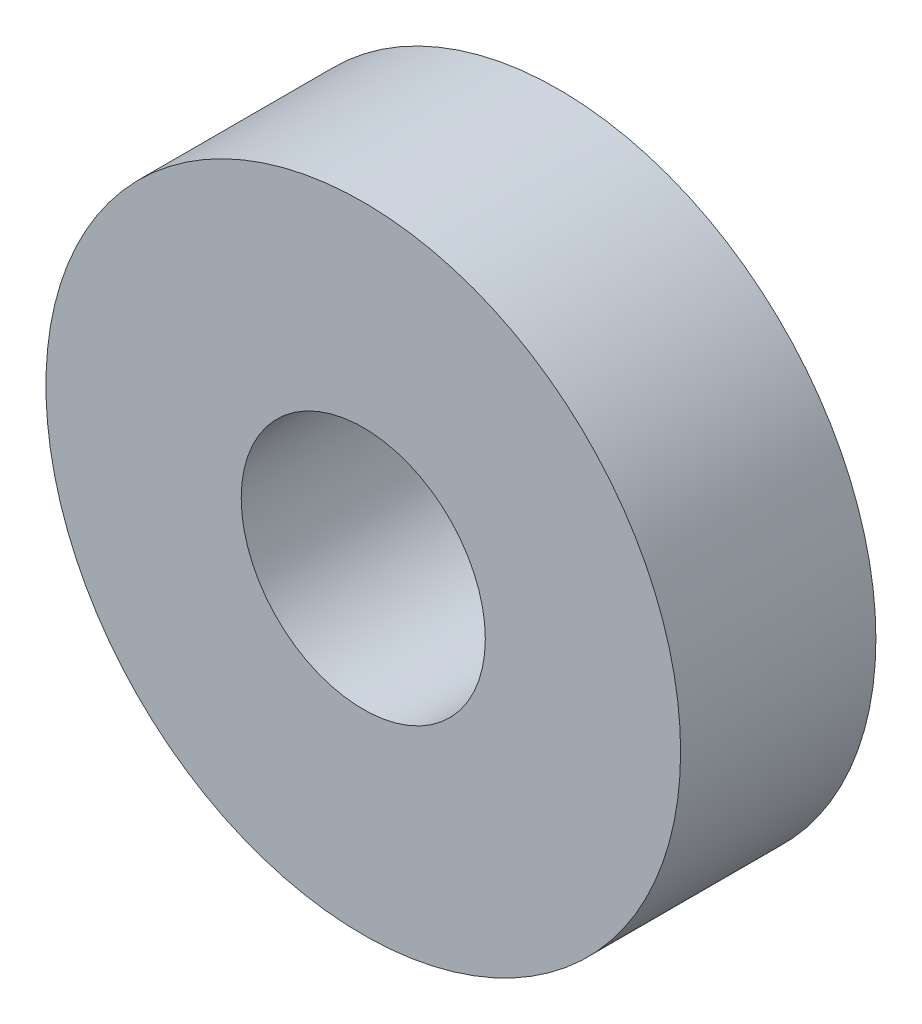
ISO-10303-21;
HEADER;
FILE_DESCRIPTION(('STEP AP214'),'2;1');
FILE_NAME('part.step','',(''),(''),'','','');
FILE_SCHEMA(('AUTOMOTIVE_DESIGN { 1 0 10303 214 1 1 1 1 }'));
ENDSEC;
DATA;
#1=APPLICATION_CONTEXT('core data for automotive mechanical design processes');
#2=APPLICATION_PROTOCOL_DEFINITION('international standard','automotive_design',2000,#1);
#3=PRODUCT_CONTEXT('',#1,'mechanical');
#4=PRODUCT('Part','Part','',(#3));
#5=PRODUCT_RELATED_PRODUCT_CATEGORY('part','',(#4));
#6=PRODUCT_DEFINITION_FORMATION('','',#4);
#7=PRODUCT_DEFINITION_CONTEXT('part definition',#1,'design');
#8=PRODUCT_DEFINITION('design','',#6,#7);
#9=PRODUCT_DEFINITION_SHAPE('','',#8);
#10=(LENGTH_UNIT() NAMED_UNIT(*) SI_UNIT(.MILLI.,.METRE.));
#11=(NAMED_UNIT(*) PLANE_ANGLE_UNIT() SI_UNIT($,.RADIAN.));
#12=(NAMED_UNIT(*) SI_UNIT($,.STERADIAN.) SOLID_ANGLE_UNIT());
#13=UNCERTAINTY_MEASURE_WITH_UNIT(LENGTH_MEASURE(1.E-05),#10,'distance_accuracy_value','');
#14=(GEOMETRIC_REPRESENTATION_CONTEXT(3) GLOBAL_UNCERTAINTY_ASSIGNED_CONTEXT((#13)) GLOBAL_UNIT_ASSIGNED_CONTEXT((#10,
#11,#12)) REPRESENTATION_CONTEXT('',''));
#15=CARTESIAN_POINT('',(0.,0.,0.));
#16=DIRECTION('',(0.,0.,1.));
#17=DIRECTION('',(1.,0.,0.));
#18=AXIS2_PLACEMENT_3D('',#15,#16,#17);
#19=CARTESIAN_POINT('',(0.,0.,8.));
#20=DIRECTION('',(0.,0.,1.));
#21=DIRECTION('',(1.,0.,0.));
#22=AXIS2_PLACEMENT_3D('',#19,#20,#21);
#23=PLANE('',#22);
#24=CARTESIAN_POINT('',(0.,0.,8.));
#25=DIRECTION('',(0.,0.,1.));
#26=DIRECTION('',(1.,0.,0.));
#27=AXIS2_PLACEMENT_3D('',#24,#25,#26);
#28=CIRCLE('',#27,13.);
#29=CARTESIAN_POINT('',(13.,0.,8.));
#30=VERTEX_POINT('',#29);
#31=EDGE_CURVE('E12',#30,#30,#28,.T.);
#32=ORIENTED_EDGE('',*,*,#31,.T.);
#33=EDGE_LOOP('',(#32));
#34=FACE_BOUND('',#33,.T.);
#35=CARTESIAN_POINT('',(0.,0.,8.));
#36=DIRECTION('',(0.,0.,1.));
#37=DIRECTION('',(1.,0.,0.));
#38=AXIS2_PLACEMENT_3D('',#35,#36,#37);
#39=CIRCLE('',#38,5.);
#40=CARTESIAN_POINT('',(5.,0.,8.));
#41=VERTEX_POINT('',#40);
#42=EDGE_CURVE('E51',#41,#41,#39,.T.);
#43=ORIENTED_EDGE('',*,*,#42,.F.);
#44=EDGE_LOOP('',(#43));
#45=FACE_BOUND('',#44,.T.);
#46=ADVANCED_FACE('F40',(#34,#45),#23,.T.);
#47=CARTESIAN_POINT('',(0.,0.,0.));
#48=DIRECTION('',(0.,0.,1.));
#49=DIRECTION('',(1.,0.,0.));
#50=AXIS2_PLACEMENT_3D('',#47,#48,#49);
#51=PLANE('',#50);
#52=CARTESIAN_POINT('',(0.,0.,0.));
#53=DIRECTION('',(0.,0.,1.));
#54=DIRECTION('',(1.,0.,0.));
#55=AXIS2_PLACEMENT_3D('',#52,#53,#54);
#56=CIRCLE('',#55,13.);
#57=CARTESIAN_POINT('',(13.,0.,0.));
#58=VERTEX_POINT('',#57);
#59=EDGE_CURVE('E44',#58,#58,#56,.T.);
#60=ORIENTED_EDGE('',*,*,#59,.F.);
#61=EDGE_LOOP('',(#60));
#62=FACE_BOUND('',#61,.T.);
#63=CARTESIAN_POINT('',(0.,0.,0.));
#64=DIRECTION('',(0.,0.,1.));
#65=DIRECTION('',(1.,0.,0.));
#66=AXIS2_PLACEMENT_3D('',#63,#64,#65);
#67=CIRCLE('',#66,5.);
#68=CARTESIAN_POINT('',(5.,0.,0.));
#69=VERTEX_POINT('',#68);
#70=EDGE_CURVE('E53',#69,#69,#67,.T.);
#71=ORIENTED_EDGE('',*,*,#70,.T.);
#72=EDGE_LOOP('',(#71));
#73=FACE_BOUND('',#72,.T.);
#74=ADVANCED_FACE('F63',(#62,#73),#51,.F.);
#75=CARTESIAN_POINT('',(0.,0.,8.));
#76=DIRECTION('',(0.,0.,-1.));
#77=DIRECTION('',(-1.,0.,0.));
#78=AXIS2_PLACEMENT_3D('',#75,#76,#77);
#79=CYLINDRICAL_SURFACE('',#78,13.);
#80=ORIENTED_EDGE('',*,*,#31,.F.);
#81=EDGE_LOOP('',(#80));
#82=FACE_BOUND('',#81,.T.);
#83=ORIENTED_EDGE('',*,*,#59,.T.);
#84=EDGE_LOOP('',(#83));
#85=FACE_BOUND('',#84,.T.);
#86=ADVANCED_FACE('F42',(#82,#85),#79,.T.);
#87=CARTESIAN_POINT('',(0.,0.,8.));
#88=DIRECTION('',(0.,0.,-1.));
#89=DIRECTION('',(-1.,0.,0.));
#90=AXIS2_PLACEMENT_3D('',#87,#88,#89);
#91=CYLINDRICAL_SURFACE('',#90,5.);
#92=ORIENTED_EDGE('',*,*,#42,.T.);
#93=EDGE_LOOP('',(#92));
#94=FACE_BOUND('',#93,.T.);
#95=ORIENTED_EDGE('',*,*,#70,.F.);
#96=EDGE_LOOP('',(#95));
#97=FACE_BOUND('',#96,.T.);
#98=ADVANCED_FACE('F59',(#94,#97),#91,.F.);
#99=CLOSED_SHELL('',(#46,#74,#86,#98));
#100=MANIFOLD_SOLID_BREP('B2',#99);
#101=ADVANCED_BREP_SHAPE_REPRESENTATION('',(#18,#100),#14);
#102=SHAPE_DEFINITION_REPRESENTATION(#9,#101);
ENDSEC;
END-ISO-10303-21;
